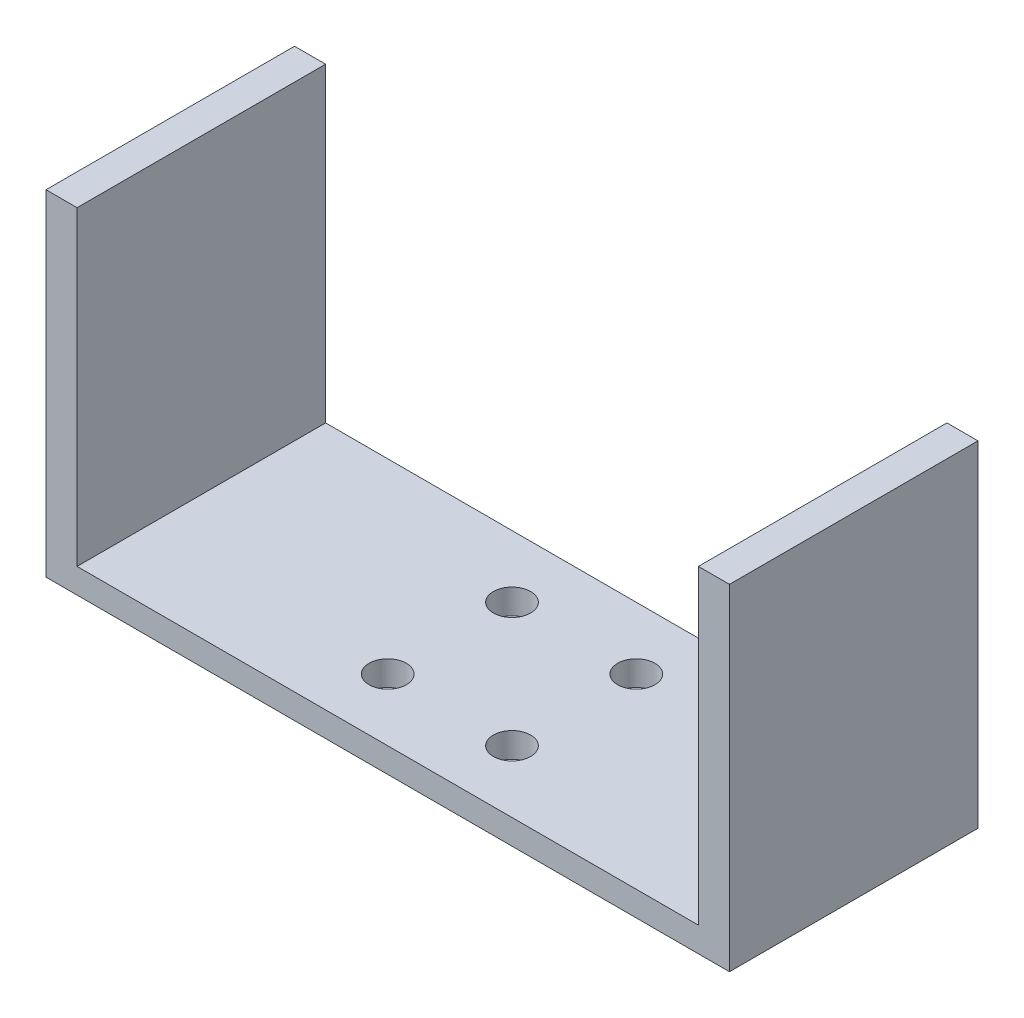
ISO-10303-21;
HEADER;
FILE_DESCRIPTION(('STEP AP214'),'2;1');
FILE_NAME('part.step','',(''),(''),'','','');
FILE_SCHEMA(('AUTOMOTIVE_DESIGN { 1 0 10303 214 1 1 1 1 }'));
ENDSEC;
DATA;
#1=APPLICATION_CONTEXT('core data for automotive mechanical design processes');
#2=APPLICATION_PROTOCOL_DEFINITION('international standard','automotive_design',2000,#1);
#3=PRODUCT_CONTEXT('',#1,'mechanical');
#4=PRODUCT('Part','Part','',(#3));
#5=PRODUCT_RELATED_PRODUCT_CATEGORY('part','',(#4));
#6=PRODUCT_DEFINITION_FORMATION('','',#4);
#7=PRODUCT_DEFINITION_CONTEXT('part definition',#1,'design');
#8=PRODUCT_DEFINITION('design','',#6,#7);
#9=PRODUCT_DEFINITION_SHAPE('','',#8);
#10=(LENGTH_UNIT() NAMED_UNIT(*) SI_UNIT(.MILLI.,.METRE.));
#11=(NAMED_UNIT(*) PLANE_ANGLE_UNIT() SI_UNIT($,.RADIAN.));
#12=(NAMED_UNIT(*) SI_UNIT($,.STERADIAN.) SOLID_ANGLE_UNIT());
#13=UNCERTAINTY_MEASURE_WITH_UNIT(LENGTH_MEASURE(1.E-05),#10,'distance_accuracy_value','');
#14=(GEOMETRIC_REPRESENTATION_CONTEXT(3) GLOBAL_UNCERTAINTY_ASSIGNED_CONTEXT((#13)) GLOBAL_UNIT_ASSIGNED_CONTEXT((#10,
#11,#12)) REPRESENTATION_CONTEXT('',''));
#15=CARTESIAN_POINT('',(0.,0.,0.));
#16=DIRECTION('',(0.,0.,1.));
#17=DIRECTION('',(1.,0.,0.));
#18=AXIS2_PLACEMENT_3D('',#15,#16,#17);
#19=CARTESIAN_POINT('',(0.,2.,0.));
#20=DIRECTION('',(0.,1.,0.));
#21=DIRECTION('',(0.,0.,1.));
#22=AXIS2_PLACEMENT_3D('',#19,#20,#21);
#23=PLANE('',#22);
#24=CARTESIAN_POINT('',(5.,2.,5.));
#25=DIRECTION('',(0.,1.,0.));
#26=DIRECTION('',(0.,0.,-1.));
#27=AXIS2_PLACEMENT_3D('',#24,#25,#26);
#28=CIRCLE('',#27,1.5);
#29=CARTESIAN_POINT('',(5.,2.,3.5));
#30=VERTEX_POINT('',#29);
#31=EDGE_CURVE('E342',#30,#30,#28,.T.);
#32=ORIENTED_EDGE('',*,*,#31,.F.);
#33=EDGE_LOOP('',(#32));
#34=FACE_BOUND('',#33,.T.);
#35=CARTESIAN_POINT('',(-5.,2.,5.));
#36=DIRECTION('',(0.,1.,0.));
#37=DIRECTION('',(0.,0.,1.));
#38=AXIS2_PLACEMENT_3D('',#35,#36,#37);
#39=CIRCLE('',#38,1.5);
#40=CARTESIAN_POINT('',(-5.,2.,6.5));
#41=VERTEX_POINT('',#40);
#42=EDGE_CURVE('E344',#41,#41,#39,.T.);
#43=ORIENTED_EDGE('',*,*,#42,.F.);
#44=EDGE_LOOP('',(#43));
#45=FACE_BOUND('',#44,.T.);
#46=CARTESIAN_POINT('',(-5.,2.,-5.));
#47=DIRECTION('',(0.,1.,0.));
#48=DIRECTION('',(0.,0.,-1.));
#49=AXIS2_PLACEMENT_3D('',#46,#47,#48);
#50=CIRCLE('',#49,1.5);
#51=CARTESIAN_POINT('',(-5.,2.,-6.5));
#52=VERTEX_POINT('',#51);
#53=EDGE_CURVE('E350',#52,#52,#50,.T.);
#54=ORIENTED_EDGE('',*,*,#53,.F.);
#55=EDGE_LOOP('',(#54));
#56=FACE_BOUND('',#55,.T.);
#57=CARTESIAN_POINT('',(5.,2.,-5.));
#58=DIRECTION('',(0.,1.,0.));
#59=DIRECTION('',(0.,0.,1.));
#60=AXIS2_PLACEMENT_3D('',#57,#58,#59);
#61=CIRCLE('',#60,1.5);
#62=CARTESIAN_POINT('',(5.,2.,-3.5));
#63=VERTEX_POINT('',#62);
#64=EDGE_CURVE('E126',#63,#63,#61,.T.);
#65=ORIENTED_EDGE('',*,*,#64,.F.);
#66=EDGE_LOOP('',(#65));
#67=FACE_BOUND('',#66,.T.);
#68=DIRECTION('',(1.,0.,0.));
#69=VECTOR('',#68,1.);
#70=CARTESIAN_POINT('',(-27.5,2.,10.));
#71=LINE('',#70,#69);
#72=CARTESIAN_POINT('',(-25.,2.,10.));
#73=VERTEX_POINT('',#72);
#74=CARTESIAN_POINT('',(25.,2.,10.));
#75=VERTEX_POINT('',#74);
#76=EDGE_CURVE('E59',#73,#75,#71,.T.);
#77=ORIENTED_EDGE('',*,*,#76,.T.);
#78=DIRECTION('',(0.,0.,1.));
#79=VECTOR('',#78,1.);
#80=CARTESIAN_POINT('',(25.,2.,-10.));
#81=LINE('',#80,#79);
#82=CARTESIAN_POINT('',(25.,2.,-10.));
#83=VERTEX_POINT('',#82);
#84=EDGE_CURVE('E54',#83,#75,#81,.T.);
#85=ORIENTED_EDGE('',*,*,#84,.F.);
#86=DIRECTION('',(-1.,0.,0.));
#87=VECTOR('',#86,1.);
#88=CARTESIAN_POINT('',(-27.5,2.,-10.));
#89=LINE('',#88,#87);
#90=CARTESIAN_POINT('',(-25.,2.,-10.));
#91=VERTEX_POINT('',#90);
#92=EDGE_CURVE('E40',#83,#91,#89,.T.);
#93=ORIENTED_EDGE('',*,*,#92,.T.);
#94=DIRECTION('',(0.,0.,-1.));
#95=VECTOR('',#94,1.);
#96=CARTESIAN_POINT('',(-25.,2.,-10.));
#97=LINE('',#96,#95);
#98=EDGE_CURVE('E135',#73,#91,#97,.T.);
#99=ORIENTED_EDGE('',*,*,#98,.F.);
#100=EDGE_LOOP('',(#77,#85,#93,#99));
#101=FACE_BOUND('',#100,.T.);
#102=ADVANCED_FACE('F36',(#34,#45,#56,#67,#101),#23,.T.);
#103=CARTESIAN_POINT('',(27.5,2.,-10.));
#104=DIRECTION('',(-1.,0.,0.));
#105=DIRECTION('',(0.,0.,1.));
#106=AXIS2_PLACEMENT_3D('',#103,#104,#105);
#107=PLANE('',#106);
#108=DIRECTION('',(0.,0.,-1.));
#109=VECTOR('',#108,1.);
#110=CARTESIAN_POINT('',(27.5,0.,-10.));
#111=LINE('',#110,#109);
#112=CARTESIAN_POINT('',(27.5,0.,10.));
#113=VERTEX_POINT('',#112);
#114=CARTESIAN_POINT('',(27.5,0.,-10.));
#115=VERTEX_POINT('',#114);
#116=EDGE_CURVE('E107',#113,#115,#111,.T.);
#117=ORIENTED_EDGE('',*,*,#116,.T.);
#118=DIRECTION('',(0.,-1.,0.));
#119=VECTOR('',#118,1.);
#120=CARTESIAN_POINT('',(27.5,2.,-10.));
#121=LINE('',#120,#119);
#122=CARTESIAN_POINT('',(27.5,27.,-10.));
#123=VERTEX_POINT('',#122);
#124=EDGE_CURVE('E11',#123,#115,#121,.T.);
#125=ORIENTED_EDGE('',*,*,#124,.F.);
#126=DIRECTION('',(0.,0.,-1.));
#127=VECTOR('',#126,1.);
#128=CARTESIAN_POINT('',(27.5,27.,-10.));
#129=LINE('',#128,#127);
#130=CARTESIAN_POINT('',(27.5,27.,10.));
#131=VERTEX_POINT('',#130);
#132=EDGE_CURVE('E105',#131,#123,#129,.T.);
#133=ORIENTED_EDGE('',*,*,#132,.F.);
#134=DIRECTION('',(0.,-1.,0.));
#135=VECTOR('',#134,1.);
#136=CARTESIAN_POINT('',(27.5,2.,10.));
#137=LINE('',#136,#135);
#138=EDGE_CURVE('E173',#131,#113,#137,.T.);
#139=ORIENTED_EDGE('',*,*,#138,.T.);
#140=EDGE_LOOP('',(#117,#125,#133,#139));
#141=FACE_BOUND('',#140,.T.);
#142=ADVANCED_FACE('F38',(#141),#107,.F.);
#143=CARTESIAN_POINT('',(-27.5,2.,-10.));
#144=DIRECTION('',(0.,0.,1.));
#145=DIRECTION('',(1.,0.,0.));
#146=AXIS2_PLACEMENT_3D('',#143,#144,#145);
#147=PLANE('',#146);
#148=DIRECTION('',(-1.,0.,0.));
#149=VECTOR('',#148,1.);
#150=CARTESIAN_POINT('',(-27.5,0.,-10.));
#151=LINE('',#150,#149);
#152=CARTESIAN_POINT('',(-27.5,0.,-10.));
#153=VERTEX_POINT('',#152);
#154=EDGE_CURVE('E164',#115,#153,#151,.T.);
#155=ORIENTED_EDGE('',*,*,#154,.T.);
#156=DIRECTION('',(0.,-1.,0.));
#157=VECTOR('',#156,1.);
#158=CARTESIAN_POINT('',(-27.5,2.,-10.));
#159=LINE('',#158,#157);
#160=CARTESIAN_POINT('',(-27.5,27.,-10.));
#161=VERTEX_POINT('',#160);
#162=EDGE_CURVE('E46',#161,#153,#159,.T.);
#163=ORIENTED_EDGE('',*,*,#162,.F.);
#164=DIRECTION('',(-1.,0.,0.));
#165=VECTOR('',#164,1.);
#166=CARTESIAN_POINT('',(-27.5,27.,-10.));
#167=LINE('',#166,#165);
#168=CARTESIAN_POINT('',(-25.,27.,-10.));
#169=VERTEX_POINT('',#168);
#170=EDGE_CURVE('E143',#169,#161,#167,.T.);
#171=ORIENTED_EDGE('',*,*,#170,.F.);
#172=DIRECTION('',(0.,-1.,0.));
#173=VECTOR('',#172,1.);
#174=CARTESIAN_POINT('',(-25.,27.,-10.));
#175=LINE('',#174,#173);
#176=EDGE_CURVE('E146',#169,#91,#175,.T.);
#177=ORIENTED_EDGE('',*,*,#176,.T.);
#178=ORIENTED_EDGE('',*,*,#92,.F.);
#179=DIRECTION('',(0.,-1.,0.));
#180=VECTOR('',#179,1.);
#181=CARTESIAN_POINT('',(25.,27.,-10.));
#182=LINE('',#181,#180);
#183=CARTESIAN_POINT('',(25.,27.,-10.));
#184=VERTEX_POINT('',#183);
#185=EDGE_CURVE('E113',#184,#83,#182,.T.);
#186=ORIENTED_EDGE('',*,*,#185,.F.);
#187=DIRECTION('',(-1.,0.,0.));
#188=VECTOR('',#187,1.);
#189=CARTESIAN_POINT('',(27.5,27.,-10.));
#190=LINE('',#189,#188);
#191=EDGE_CURVE('E110',#123,#184,#190,.T.);
#192=ORIENTED_EDGE('',*,*,#191,.F.);
#193=ORIENTED_EDGE('',*,*,#124,.T.);
#194=EDGE_LOOP('',(#155,#163,#171,#177,#178,#186,#192,#193));
#195=FACE_BOUND('',#194,.T.);
#196=ADVANCED_FACE('F111',(#195),#147,.F.);
#197=CARTESIAN_POINT('',(-27.5,2.,-10.));
#198=DIRECTION('',(1.,0.,0.));
#199=DIRECTION('',(0.,0.,-1.));
#200=AXIS2_PLACEMENT_3D('',#197,#198,#199);
#201=PLANE('',#200);
#202=DIRECTION('',(0.,0.,1.));
#203=VECTOR('',#202,1.);
#204=CARTESIAN_POINT('',(-27.5,0.,-10.));
#205=LINE('',#204,#203);
#206=CARTESIAN_POINT('',(-27.5,0.,10.));
#207=VERTEX_POINT('',#206);
#208=EDGE_CURVE('E166',#153,#207,#205,.T.);
#209=ORIENTED_EDGE('',*,*,#208,.T.);
#210=DIRECTION('',(0.,-1.,0.));
#211=VECTOR('',#210,1.);
#212=CARTESIAN_POINT('',(-27.5,2.,10.));
#213=LINE('',#212,#211);
#214=CARTESIAN_POINT('',(-27.5,27.,10.));
#215=VERTEX_POINT('',#214);
#216=EDGE_CURVE('E175',#215,#207,#213,.T.);
#217=ORIENTED_EDGE('',*,*,#216,.F.);
#218=DIRECTION('',(0.,0.,1.));
#219=VECTOR('',#218,1.);
#220=CARTESIAN_POINT('',(-27.5,27.,-10.));
#221=LINE('',#220,#219);
#222=EDGE_CURVE('E136',#161,#215,#221,.T.);
#223=ORIENTED_EDGE('',*,*,#222,.F.);
#224=ORIENTED_EDGE('',*,*,#162,.T.);
#225=EDGE_LOOP('',(#209,#217,#223,#224));
#226=FACE_BOUND('',#225,.T.);
#227=ADVANCED_FACE('F182',(#226),#201,.F.);
#228=CARTESIAN_POINT('',(-27.5,2.,10.));
#229=DIRECTION('',(0.,0.,-1.));
#230=DIRECTION('',(-1.,0.,0.));
#231=AXIS2_PLACEMENT_3D('',#228,#229,#230);
#232=PLANE('',#231);
#233=DIRECTION('',(1.,0.,0.));
#234=VECTOR('',#233,1.);
#235=CARTESIAN_POINT('',(-27.5,0.,10.));
#236=LINE('',#235,#234);
#237=EDGE_CURVE('E171',#207,#113,#236,.T.);
#238=ORIENTED_EDGE('',*,*,#237,.T.);
#239=ORIENTED_EDGE('',*,*,#138,.F.);
#240=DIRECTION('',(1.,0.,0.));
#241=VECTOR('',#240,1.);
#242=CARTESIAN_POINT('',(27.5,27.,10.));
#243=LINE('',#242,#241);
#244=CARTESIAN_POINT('',(25.,27.,10.));
#245=VERTEX_POINT('',#244);
#246=EDGE_CURVE('E121',#245,#131,#243,.T.);
#247=ORIENTED_EDGE('',*,*,#246,.F.);
#248=DIRECTION('',(0.,-1.,0.));
#249=VECTOR('',#248,1.);
#250=CARTESIAN_POINT('',(25.,27.,10.));
#251=LINE('',#250,#249);
#252=EDGE_CURVE('E130',#245,#75,#251,.T.);
#253=ORIENTED_EDGE('',*,*,#252,.T.);
#254=ORIENTED_EDGE('',*,*,#76,.F.);
#255=DIRECTION('',(0.,-1.,0.));
#256=VECTOR('',#255,1.);
#257=CARTESIAN_POINT('',(-25.,27.,10.));
#258=LINE('',#257,#256);
#259=CARTESIAN_POINT('',(-25.,27.,10.));
#260=VERTEX_POINT('',#259);
#261=EDGE_CURVE('E156',#260,#73,#258,.T.);
#262=ORIENTED_EDGE('',*,*,#261,.F.);
#263=DIRECTION('',(1.,0.,0.));
#264=VECTOR('',#263,1.);
#265=CARTESIAN_POINT('',(-27.5,27.,10.));
#266=LINE('',#265,#264);
#267=EDGE_CURVE('E139',#215,#260,#266,.T.);
#268=ORIENTED_EDGE('',*,*,#267,.F.);
#269=ORIENTED_EDGE('',*,*,#216,.T.);
#270=EDGE_LOOP('',(#238,#239,#247,#253,#254,#262,#268,#269));
#271=FACE_BOUND('',#270,.T.);
#272=ADVANCED_FACE('F188',(#271),#232,.F.);
#273=CARTESIAN_POINT('',(0.,0.,0.));
#274=DIRECTION('',(0.,1.,0.));
#275=DIRECTION('',(0.,0.,1.));
#276=AXIS2_PLACEMENT_3D('',#273,#274,#275);
#277=PLANE('',#276);
#278=CARTESIAN_POINT('',(5.,0.,5.));
#279=DIRECTION('',(0.,1.,0.));
#280=DIRECTION('',(0.,0.,-1.));
#281=AXIS2_PLACEMENT_3D('',#278,#279,#280);
#282=CIRCLE('',#281,1.5);
#283=CARTESIAN_POINT('',(5.,0.,3.5));
#284=VERTEX_POINT('',#283);
#285=EDGE_CURVE('E340',#284,#284,#282,.T.);
#286=ORIENTED_EDGE('',*,*,#285,.T.);
#287=EDGE_LOOP('',(#286));
#288=FACE_BOUND('',#287,.T.);
#289=CARTESIAN_POINT('',(-5.,0.,5.));
#290=DIRECTION('',(0.,1.,0.));
#291=DIRECTION('',(0.,0.,1.));
#292=AXIS2_PLACEMENT_3D('',#289,#290,#291);
#293=CIRCLE('',#292,1.5);
#294=CARTESIAN_POINT('',(-5.,0.,6.5));
#295=VERTEX_POINT('',#294);
#296=EDGE_CURVE('E347',#295,#295,#293,.T.);
#297=ORIENTED_EDGE('',*,*,#296,.T.);
#298=EDGE_LOOP('',(#297));
#299=FACE_BOUND('',#298,.T.);
#300=CARTESIAN_POINT('',(-5.,0.,-5.));
#301=DIRECTION('',(0.,1.,0.));
#302=DIRECTION('',(0.,0.,-1.));
#303=AXIS2_PLACEMENT_3D('',#300,#301,#302);
#304=CIRCLE('',#303,1.5);
#305=CARTESIAN_POINT('',(-5.,0.,-6.5));
#306=VERTEX_POINT('',#305);
#307=EDGE_CURVE('E353',#306,#306,#304,.T.);
#308=ORIENTED_EDGE('',*,*,#307,.T.);
#309=EDGE_LOOP('',(#308));
#310=FACE_BOUND('',#309,.T.);
#311=CARTESIAN_POINT('',(5.,0.,-5.));
#312=DIRECTION('',(0.,1.,0.));
#313=DIRECTION('',(0.,0.,1.));
#314=AXIS2_PLACEMENT_3D('',#311,#312,#313);
#315=CIRCLE('',#314,1.5);
#316=CARTESIAN_POINT('',(5.,0.,-3.5));
#317=VERTEX_POINT('',#316);
#318=EDGE_CURVE('E123',#317,#317,#315,.T.);
#319=ORIENTED_EDGE('',*,*,#318,.T.);
#320=EDGE_LOOP('',(#319));
#321=FACE_BOUND('',#320,.T.);
#322=ORIENTED_EDGE('',*,*,#116,.F.);
#323=ORIENTED_EDGE('',*,*,#237,.F.);
#324=ORIENTED_EDGE('',*,*,#208,.F.);
#325=ORIENTED_EDGE('',*,*,#154,.F.);
#326=EDGE_LOOP('',(#322,#323,#324,#325));
#327=FACE_BOUND('',#326,.T.);
#328=ADVANCED_FACE('F186',(#288,#299,#310,#321,#327),#277,.F.);
#329=CARTESIAN_POINT('',(-25.,27.,-10.));
#330=DIRECTION('',(-1.,0.,0.));
#331=DIRECTION('',(0.,0.,1.));
#332=AXIS2_PLACEMENT_3D('',#329,#330,#331);
#333=PLANE('',#332);
#334=ORIENTED_EDGE('',*,*,#98,.T.);
#335=ORIENTED_EDGE('',*,*,#176,.F.);
#336=DIRECTION('',(0.,0.,-1.));
#337=VECTOR('',#336,1.);
#338=CARTESIAN_POINT('',(-25.,27.,-10.));
#339=LINE('',#338,#337);
#340=EDGE_CURVE('E141',#260,#169,#339,.T.);
#341=ORIENTED_EDGE('',*,*,#340,.F.);
#342=ORIENTED_EDGE('',*,*,#261,.T.);
#343=EDGE_LOOP('',(#334,#335,#341,#342));
#344=FACE_BOUND('',#343,.T.);
#345=ADVANCED_FACE('F193',(#344),#333,.F.);
#346=CARTESIAN_POINT('',(0.,27.,0.));
#347=DIRECTION('',(0.,1.,0.));
#348=DIRECTION('',(0.,0.,1.));
#349=AXIS2_PLACEMENT_3D('',#346,#347,#348);
#350=PLANE('',#349);
#351=ORIENTED_EDGE('',*,*,#222,.T.);
#352=ORIENTED_EDGE('',*,*,#267,.T.);
#353=ORIENTED_EDGE('',*,*,#340,.T.);
#354=ORIENTED_EDGE('',*,*,#170,.T.);
#355=EDGE_LOOP('',(#351,#352,#353,#354));
#356=FACE_BOUND('',#355,.T.);
#357=ADVANCED_FACE('F191',(#356),#350,.T.);
#358=CARTESIAN_POINT('',(25.,27.,-10.));
#359=DIRECTION('',(1.,0.,0.));
#360=DIRECTION('',(0.,0.,-1.));
#361=AXIS2_PLACEMENT_3D('',#358,#359,#360);
#362=PLANE('',#361);
#363=ORIENTED_EDGE('',*,*,#84,.T.);
#364=ORIENTED_EDGE('',*,*,#252,.F.);
#365=DIRECTION('',(0.,0.,1.));
#366=VECTOR('',#365,1.);
#367=CARTESIAN_POINT('',(25.,27.,-10.));
#368=LINE('',#367,#366);
#369=EDGE_CURVE('E116',#184,#245,#368,.T.);
#370=ORIENTED_EDGE('',*,*,#369,.F.);
#371=ORIENTED_EDGE('',*,*,#185,.T.);
#372=EDGE_LOOP('',(#363,#364,#370,#371));
#373=FACE_BOUND('',#372,.T.);
#374=ADVANCED_FACE('F196',(#373),#362,.F.);
#375=CARTESIAN_POINT('',(0.,27.,0.));
#376=DIRECTION('',(0.,-1.,0.));
#377=DIRECTION('',(0.,0.,-1.));
#378=AXIS2_PLACEMENT_3D('',#375,#376,#377);
#379=PLANE('',#378);
#380=ORIENTED_EDGE('',*,*,#132,.T.);
#381=ORIENTED_EDGE('',*,*,#191,.T.);
#382=ORIENTED_EDGE('',*,*,#369,.T.);
#383=ORIENTED_EDGE('',*,*,#246,.T.);
#384=EDGE_LOOP('',(#380,#381,#382,#383));
#385=FACE_BOUND('',#384,.T.);
#386=ADVANCED_FACE('F119',(#385),#379,.F.);
#387=CARTESIAN_POINT('',(5.,0.,-5.));
#388=DIRECTION('',(0.,1.,0.));
#389=DIRECTION('',(0.,0.,1.));
#390=AXIS2_PLACEMENT_3D('',#387,#388,#389);
#391=CYLINDRICAL_SURFACE('',#390,1.5);
#392=ORIENTED_EDGE('',*,*,#318,.F.);
#393=EDGE_LOOP('',(#392));
#394=FACE_BOUND('',#393,.T.);
#395=ORIENTED_EDGE('',*,*,#64,.T.);
#396=EDGE_LOOP('',(#395));
#397=FACE_BOUND('',#396,.T.);
#398=ADVANCED_FACE('F203',(#394,#397),#391,.F.);
#399=CARTESIAN_POINT('',(-5.,0.,-5.));
#400=DIRECTION('',(0.,1.,0.));
#401=DIRECTION('',(0.,0.,1.));
#402=AXIS2_PLACEMENT_3D('',#399,#400,#401);
#403=CYLINDRICAL_SURFACE('',#402,1.5);
#404=ORIENTED_EDGE('',*,*,#307,.F.);
#405=EDGE_LOOP('',(#404));
#406=FACE_BOUND('',#405,.T.);
#407=ORIENTED_EDGE('',*,*,#53,.T.);
#408=EDGE_LOOP('',(#407));
#409=FACE_BOUND('',#408,.T.);
#410=ADVANCED_FACE('F303',(#406,#409),#403,.F.);
#411=CARTESIAN_POINT('',(-5.,0.,5.));
#412=DIRECTION('',(0.,1.,0.));
#413=DIRECTION('',(0.,0.,1.));
#414=AXIS2_PLACEMENT_3D('',#411,#412,#413);
#415=CYLINDRICAL_SURFACE('',#414,1.5);
#416=ORIENTED_EDGE('',*,*,#296,.F.);
#417=EDGE_LOOP('',(#416));
#418=FACE_BOUND('',#417,.T.);
#419=ORIENTED_EDGE('',*,*,#42,.T.);
#420=EDGE_LOOP('',(#419));
#421=FACE_BOUND('',#420,.T.);
#422=ADVANCED_FACE('F310',(#418,#421),#415,.F.);
#423=CARTESIAN_POINT('',(5.,0.,5.));
#424=DIRECTION('',(0.,1.,0.));
#425=DIRECTION('',(0.,0.,1.));
#426=AXIS2_PLACEMENT_3D('',#423,#424,#425);
#427=CYLINDRICAL_SURFACE('',#426,1.5);
#428=ORIENTED_EDGE('',*,*,#285,.F.);
#429=EDGE_LOOP('',(#428));
#430=FACE_BOUND('',#429,.T.);
#431=ORIENTED_EDGE('',*,*,#31,.T.);
#432=EDGE_LOOP('',(#431));
#433=FACE_BOUND('',#432,.T.);
#434=ADVANCED_FACE('F318',(#430,#433),#427,.F.);
#435=CLOSED_SHELL('',(#102,#142,#196,#227,#272,#328,#345,#357,#374,#386,#398,#410,#422,#434));
#436=MANIFOLD_SOLID_BREP('B2',#435);
#437=ADVANCED_BREP_SHAPE_REPRESENTATION('',(#18,#436),#14);
#438=SHAPE_DEFINITION_REPRESENTATION(#9,#437);
ENDSEC;
END-ISO-10303-21;
